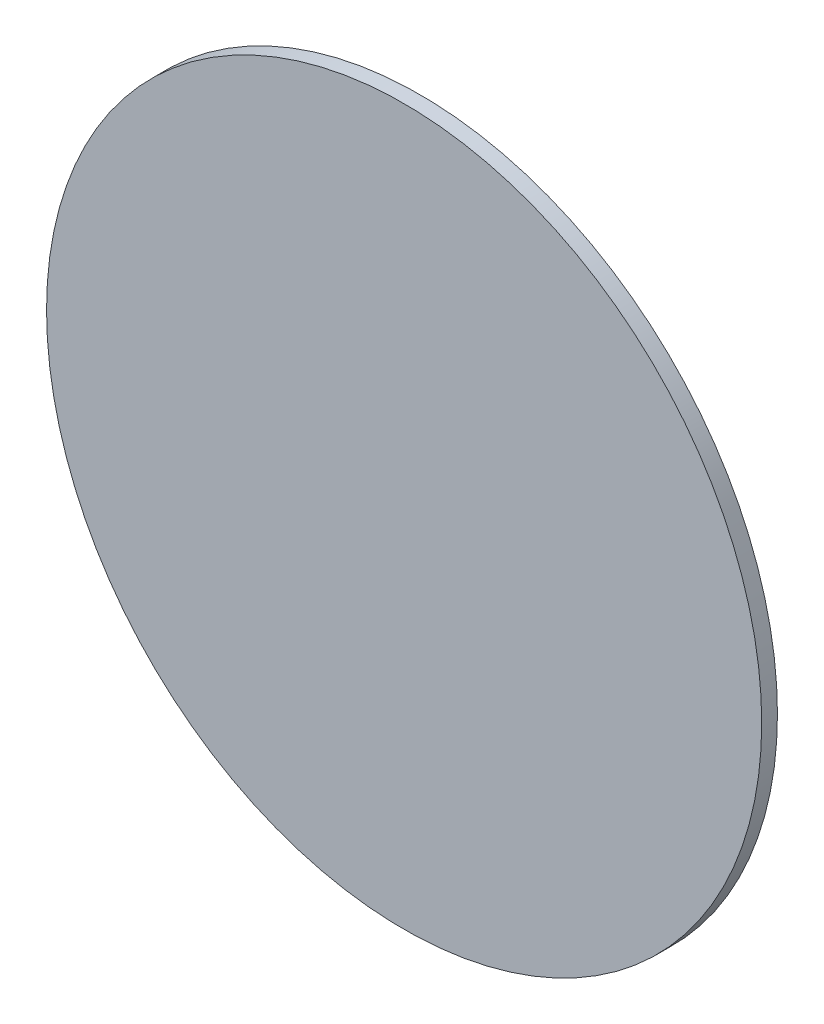
ISO-10303-21;
HEADER;
FILE_DESCRIPTION(('STEP AP214'),'2;1');
FILE_NAME('part.step','',(''),(''),'','','');
FILE_SCHEMA(('AUTOMOTIVE_DESIGN { 1 0 10303 214 1 1 1 1 }'));
ENDSEC;
DATA;
#1=APPLICATION_CONTEXT('core data for automotive mechanical design processes');
#2=APPLICATION_PROTOCOL_DEFINITION('international standard','automotive_design',2000,#1);
#3=PRODUCT_CONTEXT('',#1,'mechanical');
#4=PRODUCT('Part','Part','',(#3));
#5=PRODUCT_RELATED_PRODUCT_CATEGORY('part','',(#4));
#6=PRODUCT_DEFINITION_FORMATION('','',#4);
#7=PRODUCT_DEFINITION_CONTEXT('part definition',#1,'design');
#8=PRODUCT_DEFINITION('design','',#6,#7);
#9=PRODUCT_DEFINITION_SHAPE('','',#8);
#10=(LENGTH_UNIT() NAMED_UNIT(*) SI_UNIT(.MILLI.,.METRE.));
#11=(NAMED_UNIT(*) PLANE_ANGLE_UNIT() SI_UNIT($,.RADIAN.));
#12=(NAMED_UNIT(*) SI_UNIT($,.STERADIAN.) SOLID_ANGLE_UNIT());
#13=UNCERTAINTY_MEASURE_WITH_UNIT(LENGTH_MEASURE(1.E-05),#10,'distance_accuracy_value','');
#14=(GEOMETRIC_REPRESENTATION_CONTEXT(3) GLOBAL_UNCERTAINTY_ASSIGNED_CONTEXT((#13)) GLOBAL_UNIT_ASSIGNED_CONTEXT((#10,
#11,#12)) REPRESENTATION_CONTEXT('',''));
#15=CARTESIAN_POINT('',(0.,0.,0.));
#16=DIRECTION('',(0.,0.,1.));
#17=DIRECTION('',(1.,0.,0.));
#18=AXIS2_PLACEMENT_3D('',#15,#16,#17);
#19=CARTESIAN_POINT('',(0.,0.,1.1));
#20=DIRECTION('',(0.,0.,-1.));
#21=DIRECTION('',(-1.,0.,0.));
#22=AXIS2_PLACEMENT_3D('',#19,#20,#21);
#23=CYLINDRICAL_SURFACE('',#22,25.);
#24=CARTESIAN_POINT('',(0.,0.,1.1));
#25=DIRECTION('',(0.,0.,1.));
#26=DIRECTION('',(1.,0.,0.));
#27=AXIS2_PLACEMENT_3D('',#24,#25,#26);
#28=CIRCLE('',#27,25.);
#29=CARTESIAN_POINT('',(25.,0.,1.1));
#30=VERTEX_POINT('',#29);
#31=EDGE_CURVE('E10',#30,#30,#28,.T.);
#32=ORIENTED_EDGE('',*,*,#31,.F.);
#33=EDGE_LOOP('',(#32));
#34=FACE_BOUND('',#33,.T.);
#35=CARTESIAN_POINT('',(0.,0.,0.));
#36=DIRECTION('',(0.,0.,1.));
#37=DIRECTION('',(1.,0.,0.));
#38=AXIS2_PLACEMENT_3D('',#35,#36,#37);
#39=CIRCLE('',#38,25.);
#40=CARTESIAN_POINT('',(25.,0.,0.));
#41=VERTEX_POINT('',#40);
#42=EDGE_CURVE('E36',#41,#41,#39,.T.);
#43=ORIENTED_EDGE('',*,*,#42,.T.);
#44=EDGE_LOOP('',(#43));
#45=FACE_BOUND('',#44,.T.);
#46=ADVANCED_FACE('F33',(#34,#45),#23,.T.);
#47=CARTESIAN_POINT('',(0.,0.,1.1));
#48=DIRECTION('',(0.,0.,1.));
#49=DIRECTION('',(1.,0.,0.));
#50=AXIS2_PLACEMENT_3D('',#47,#48,#49);
#51=PLANE('',#50);
#52=ORIENTED_EDGE('',*,*,#31,.T.);
#53=EDGE_LOOP('',(#52));
#54=FACE_BOUND('',#53,.T.);
#55=ADVANCED_FACE('F48',(#54),#51,.T.);
#56=CARTESIAN_POINT('',(0.,0.,0.));
#57=DIRECTION('',(0.,0.,1.));
#58=DIRECTION('',(1.,0.,0.));
#59=AXIS2_PLACEMENT_3D('',#56,#57,#58);
#60=PLANE('',#59);
#61=ORIENTED_EDGE('',*,*,#42,.F.);
#62=EDGE_LOOP('',(#61));
#63=FACE_BOUND('',#62,.T.);
#64=ADVANCED_FACE('F46',(#63),#60,.F.);
#65=CLOSED_SHELL('',(#46,#55,#64));
#66=MANIFOLD_SOLID_BREP('B2',#65);
#67=ADVANCED_BREP_SHAPE_REPRESENTATION('',(#18,#66),#14);
#68=SHAPE_DEFINITION_REPRESENTATION(#9,#67);
ENDSEC;
END-ISO-10303-21;
